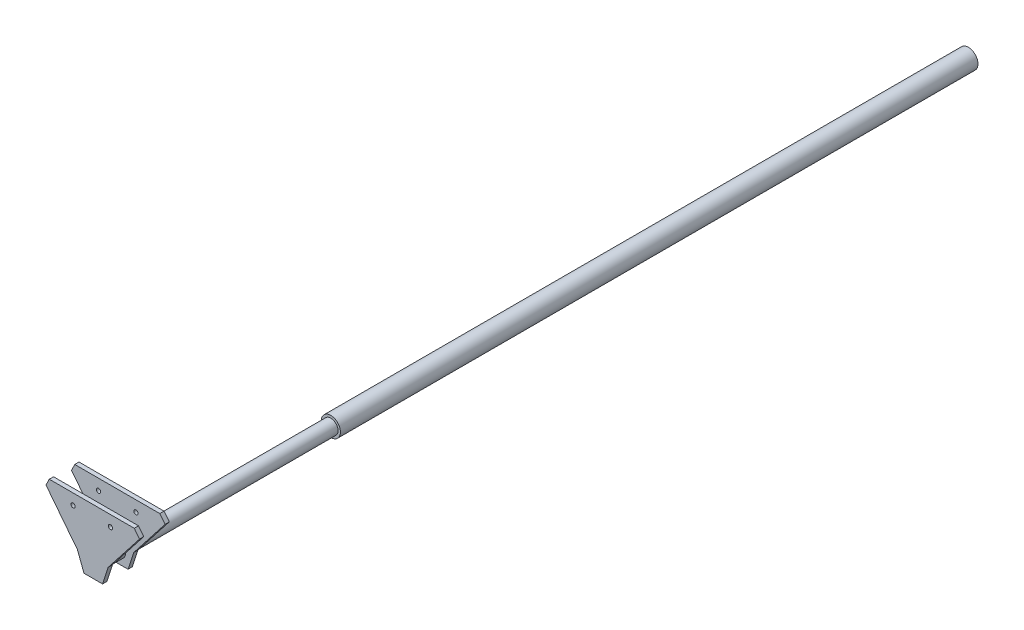
ISO-10303-21;
HEADER;
FILE_DESCRIPTION(('STEP AP214'),'2;1');
FILE_NAME('part.step','',(''),(''),'','','');
FILE_SCHEMA(('AUTOMOTIVE_DESIGN { 1 0 10303 214 1 1 1 1 }'));
ENDSEC;
DATA;
#1=APPLICATION_CONTEXT('core data for automotive mechanical design processes');
#2=APPLICATION_PROTOCOL_DEFINITION('international standard','automotive_design',2000,#1);
#3=PRODUCT_CONTEXT('',#1,'mechanical');
#4=PRODUCT('Part','Part','',(#3));
#5=PRODUCT_RELATED_PRODUCT_CATEGORY('part','',(#4));
#6=PRODUCT_DEFINITION_FORMATION('','',#4);
#7=PRODUCT_DEFINITION_CONTEXT('part definition',#1,'design');
#8=PRODUCT_DEFINITION('design','',#6,#7);
#9=PRODUCT_DEFINITION_SHAPE('','',#8);
#10=(LENGTH_UNIT() NAMED_UNIT(*) SI_UNIT(.MILLI.,.METRE.));
#11=(NAMED_UNIT(*) PLANE_ANGLE_UNIT() SI_UNIT($,.RADIAN.));
#12=(NAMED_UNIT(*) SI_UNIT($,.STERADIAN.) SOLID_ANGLE_UNIT());
#13=UNCERTAINTY_MEASURE_WITH_UNIT(LENGTH_MEASURE(1.E-05),#10,'distance_accuracy_value','');
#14=(GEOMETRIC_REPRESENTATION_CONTEXT(3) GLOBAL_UNCERTAINTY_ASSIGNED_CONTEXT((#13)) GLOBAL_UNIT_ASSIGNED_CONTEXT((#10,
#11,#12)) REPRESENTATION_CONTEXT('',''));
#15=CARTESIAN_POINT('',(0.,0.,0.));
#16=DIRECTION('',(0.,0.,1.));
#17=DIRECTION('',(1.,0.,0.));
#18=AXIS2_PLACEMENT_3D('',#15,#16,#17);
#19=CARTESIAN_POINT('',(0.,0.,370.));
#20=DIRECTION('',(0.,0.,-1.));
#21=DIRECTION('',(-1.,0.,0.));
#22=AXIS2_PLACEMENT_3D('',#19,#20,#21);
#23=CYLINDRICAL_SURFACE('',#22,11.3);
#24=CARTESIAN_POINT('',(0.,0.,370.));
#25=DIRECTION('',(0.,0.,1.));
#26=DIRECTION('',(1.,0.,0.));
#27=AXIS2_PLACEMENT_3D('',#24,#25,#26);
#28=CIRCLE('',#27,11.3);
#29=CARTESIAN_POINT('',(11.3,0.,370.));
#30=VERTEX_POINT('',#29);
#31=EDGE_CURVE('E200',#30,#30,#28,.T.);
#32=ORIENTED_EDGE('',*,*,#31,.F.);
#33=EDGE_LOOP('',(#32));
#34=FACE_BOUND('',#33,.T.);
#35=CARTESIAN_POINT('',(0.,0.,-380.));
#36=DIRECTION('',(0.,0.,1.));
#37=DIRECTION('',(1.,0.,0.));
#38=AXIS2_PLACEMENT_3D('',#35,#36,#37);
#39=CIRCLE('',#38,11.3);
#40=CARTESIAN_POINT('',(11.3,0.,-380.));
#41=VERTEX_POINT('',#40);
#42=EDGE_CURVE('E204',#41,#41,#39,.T.);
#43=ORIENTED_EDGE('',*,*,#42,.T.);
#44=EDGE_LOOP('',(#43));
#45=FACE_BOUND('',#44,.T.);
#46=ADVANCED_FACE('F43',(#34,#45),#23,.T.);
#47=CARTESIAN_POINT('',(0.,0.,370.));
#48=DIRECTION('',(0.,0.,1.));
#49=DIRECTION('',(1.,0.,0.));
#50=AXIS2_PLACEMENT_3D('',#47,#48,#49);
#51=PLANE('',#50);
#52=CARTESIAN_POINT('',(0.,0.,370.));
#53=DIRECTION('',(0.,0.,1.));
#54=DIRECTION('',(1.,0.,0.));
#55=AXIS2_PLACEMENT_3D('',#52,#53,#54);
#56=CIRCLE('',#55,8.5);
#57=CARTESIAN_POINT('',(8.5,0.,370.));
#58=VERTEX_POINT('',#57);
#59=EDGE_CURVE('E53',#58,#58,#56,.T.);
#60=ORIENTED_EDGE('',*,*,#59,.F.);
#61=EDGE_LOOP('',(#60));
#62=FACE_BOUND('',#61,.T.);
#63=ORIENTED_EDGE('',*,*,#31,.T.);
#64=EDGE_LOOP('',(#63));
#65=FACE_BOUND('',#64,.T.);
#66=ADVANCED_FACE('F381',(#62,#65),#51,.T.);
#67=CARTESIAN_POINT('',(0.,0.,-380.));
#68=DIRECTION('',(0.,0.,1.));
#69=DIRECTION('',(1.,0.,0.));
#70=AXIS2_PLACEMENT_3D('',#67,#68,#69);
#71=PLANE('',#70);
#72=ORIENTED_EDGE('',*,*,#42,.F.);
#73=EDGE_LOOP('',(#72));
#74=FACE_BOUND('',#73,.T.);
#75=ADVANCED_FACE('F386',(#74),#71,.F.);
#76=CARTESIAN_POINT('',(0.,0.,650.));
#77=DIRECTION('',(0.,0.,-1.));
#78=DIRECTION('',(-1.,0.,0.));
#79=AXIS2_PLACEMENT_3D('',#76,#77,#78);
#80=CYLINDRICAL_SURFACE('',#79,8.5);
#81=CARTESIAN_POINT('',(0.,0.,615.));
#82=DIRECTION('',(0.,0.,-1.));
#83=DIRECTION('',(-1.,0.,0.));
#84=AXIS2_PLACEMENT_3D('',#81,#82,#83);
#85=CIRCLE('',#84,8.5);
#86=CARTESIAN_POINT('',(-8.5,0.,615.));
#87=VERTEX_POINT('',#86);
#88=EDGE_CURVE('E154',#87,#87,#85,.T.);
#89=ORIENTED_EDGE('',*,*,#88,.T.);
#90=EDGE_LOOP('',(#89));
#91=FACE_BOUND('',#90,.T.);
#92=ORIENTED_EDGE('',*,*,#59,.T.);
#93=EDGE_LOOP('',(#92));
#94=FACE_BOUND('',#93,.T.);
#95=ADVANCED_FACE('F394',(#91,#94),#80,.T.);
#96=CARTESIAN_POINT('',(-10.36978253,-14.68790239,615.));
#97=DIRECTION('',(-0.934741660336349,-0.355328057478783,0.));
#98=DIRECTION('',(0.355328057478783,-0.934741660336349,0.));
#99=AXIS2_PLACEMENT_3D('',#96,#97,#98);
#100=PLANE('',#99);
#101=DIRECTION('',(0.355328057478783,-0.934741660336349,0.));
#102=VECTOR('',#101,1.);
#103=CARTESIAN_POINT('',(-10.36978253,-14.68790239,620.));
#104=LINE('',#103,#102);
#105=CARTESIAN_POINT('',(-18.0715503081688,5.57270762647871,620.));
#106=VERTEX_POINT('',#105);
#107=CARTESIAN_POINT('',(-10.36978253,-14.68790239,620.));
#108=VERTEX_POINT('',#107);
#109=EDGE_CURVE('E252',#106,#108,#104,.T.);
#110=ORIENTED_EDGE('',*,*,#109,.F.);
#111=DIRECTION('',(0.,0.,1.));
#112=VECTOR('',#111,1.);
#113=CARTESIAN_POINT('',(-18.0715503081688,5.57270762647871,615.));
#114=LINE('',#113,#112);
#115=CARTESIAN_POINT('',(-18.0715503081688,5.57270762647871,615.));
#116=VERTEX_POINT('',#115);
#117=EDGE_CURVE('E314',#116,#106,#114,.T.);
#118=ORIENTED_EDGE('',*,*,#117,.F.);
#119=DIRECTION('',(0.355328057478783,-0.934741660336349,0.));
#120=VECTOR('',#119,1.);
#121=CARTESIAN_POINT('',(-10.36978253,-14.68790239,615.));
#122=LINE('',#121,#120);
#123=CARTESIAN_POINT('',(-10.36978253,-14.68790239,615.));
#124=VERTEX_POINT('',#123);
#125=EDGE_CURVE('E276',#116,#124,#122,.T.);
#126=ORIENTED_EDGE('',*,*,#125,.T.);
#127=DIRECTION('',(0.,0.,1.));
#128=VECTOR('',#127,1.);
#129=CARTESIAN_POINT('',(-10.36978253,-14.68790239,615.));
#130=LINE('',#129,#128);
#131=EDGE_CURVE('E213',#124,#108,#130,.T.);
#132=ORIENTED_EDGE('',*,*,#131,.T.);
#133=EDGE_LOOP('',(#110,#118,#126,#132));
#134=FACE_BOUND('',#133,.T.);
#135=ADVANCED_FACE('F398',(#134),#100,.T.);
#136=CARTESIAN_POINT('',(-18.0715503081688,5.57270762647871,615.));
#137=DIRECTION('',(-0.787803300904097,-0.615926910505304,0.));
#138=DIRECTION('',(0.615926910505304,-0.787803300904097,0.));
#139=AXIS2_PLACEMENT_3D('',#136,#137,#138);
#140=PLANE('',#139);
#141=DIRECTION('',(0.615926910505304,-0.787803300904097,0.));
#142=VECTOR('',#141,1.);
#143=CARTESIAN_POINT('',(-18.0715503081688,5.57270762647871,620.));
#144=LINE('',#143,#142);
#145=CARTESIAN_POINT('',(-55.0271649384871,52.8409056807245,620.));
#146=VERTEX_POINT('',#145);
#147=EDGE_CURVE('E304',#146,#106,#144,.T.);
#148=ORIENTED_EDGE('',*,*,#147,.F.);
#149=DIRECTION('',(0.,0.,1.));
#150=VECTOR('',#149,1.);
#151=CARTESIAN_POINT('',(-55.0271649384871,52.8409056807245,615.));
#152=LINE('',#151,#150);
#153=CARTESIAN_POINT('',(-55.0271649384871,52.8409056807245,615.));
#154=VERTEX_POINT('',#153);
#155=EDGE_CURVE('E318',#154,#146,#152,.T.);
#156=ORIENTED_EDGE('',*,*,#155,.F.);
#157=DIRECTION('',(0.615926910505304,-0.787803300904097,0.));
#158=VECTOR('',#157,1.);
#159=CARTESIAN_POINT('',(-18.0715503081688,5.57270762647871,615.));
#160=LINE('',#159,#158);
#161=EDGE_CURVE('E272',#154,#116,#160,.T.);
#162=ORIENTED_EDGE('',*,*,#161,.T.);
#163=ORIENTED_EDGE('',*,*,#117,.T.);
#164=EDGE_LOOP('',(#148,#156,#162,#163));
#165=FACE_BOUND('',#164,.T.);
#166=ADVANCED_FACE('F534',(#165),#140,.T.);
#167=CARTESIAN_POINT('',(-51.1864340438746,60.7188569042528,615.));
#168=DIRECTION('',(-0.898866082182163,0.438223420531683,0.));
#169=DIRECTION('',(-0.438223420531683,-0.898866082182163,0.));
#170=AXIS2_PLACEMENT_3D('',#167,#168,#169);
#171=PLANE('',#170);
#172=DIRECTION('',(-0.438223420531683,-0.898866082182163,0.));
#173=VECTOR('',#172,1.);
#174=CARTESIAN_POINT('',(-51.1864340438746,60.7188569042528,620.));
#175=LINE('',#174,#173);
#176=CARTESIAN_POINT('',(-51.1864340438746,60.7188569042528,620.));
#177=VERTEX_POINT('',#176);
#178=EDGE_CURVE('E300',#177,#146,#175,.T.);
#179=ORIENTED_EDGE('',*,*,#178,.F.);
#180=DIRECTION('',(0.,0.,1.));
#181=VECTOR('',#180,1.);
#182=CARTESIAN_POINT('',(-51.1864340438746,60.7188569042528,615.));
#183=LINE('',#182,#181);
#184=CARTESIAN_POINT('',(-51.1864340438746,60.7188569042528,615.));
#185=VERTEX_POINT('',#184);
#186=EDGE_CURVE('E322',#185,#177,#183,.T.);
#187=ORIENTED_EDGE('',*,*,#186,.F.);
#188=DIRECTION('',(-0.438223420531683,-0.898866082182163,0.));
#189=VECTOR('',#188,1.);
#190=CARTESIAN_POINT('',(-51.1864340438746,60.7188569042528,615.));
#191=LINE('',#190,#189);
#192=EDGE_CURVE('E268',#185,#154,#191,.T.);
#193=ORIENTED_EDGE('',*,*,#192,.T.);
#194=ORIENTED_EDGE('',*,*,#155,.T.);
#195=EDGE_LOOP('',(#179,#187,#193,#194));
#196=FACE_BOUND('',#195,.T.);
#197=ADVANCED_FACE('F544',(#196),#171,.T.);
#198=CARTESIAN_POINT('',(-51.1864340438746,60.7188569042528,615.));
#199=DIRECTION('',(0.,1.,0.));
#200=DIRECTION('',(0.,0.,1.));
#201=AXIS2_PLACEMENT_3D('',#198,#199,#200);
#202=PLANE('',#201);
#203=DIRECTION('',(-1.,0.,0.));
#204=VECTOR('',#203,1.);
#205=CARTESIAN_POINT('',(-51.1864340438746,60.7188569042528,620.));
#206=LINE('',#205,#204);
#207=CARTESIAN_POINT('',(48.8135659561254,60.7188569042528,620.));
#208=VERTEX_POINT('',#207);
#209=EDGE_CURVE('E296',#208,#177,#206,.T.);
#210=ORIENTED_EDGE('',*,*,#209,.F.);
#211=DIRECTION('',(0.,0.,1.));
#212=VECTOR('',#211,1.);
#213=CARTESIAN_POINT('',(48.8135659561254,60.7188569042528,615.));
#214=LINE('',#213,#212);
#215=CARTESIAN_POINT('',(48.8135659561254,60.7188569042528,615.));
#216=VERTEX_POINT('',#215);
#217=EDGE_CURVE('E326',#216,#208,#214,.T.);
#218=ORIENTED_EDGE('',*,*,#217,.F.);
#219=DIRECTION('',(-1.,0.,0.));
#220=VECTOR('',#219,1.);
#221=CARTESIAN_POINT('',(-51.1864340438746,60.7188569042528,615.));
#222=LINE('',#221,#220);
#223=EDGE_CURVE('E264',#216,#185,#222,.T.);
#224=ORIENTED_EDGE('',*,*,#223,.T.);
#225=ORIENTED_EDGE('',*,*,#186,.T.);
#226=EDGE_LOOP('',(#210,#218,#224,#225));
#227=FACE_BOUND('',#226,.T.);
#228=ADVANCED_FACE('F554',(#227),#202,.T.);
#229=CARTESIAN_POINT('',(48.8135659561254,60.7188569042528,615.));
#230=DIRECTION('',(0.785108717675389,0.61935797518891,0.));
#231=DIRECTION('',(-0.61935797518891,0.785108717675389,0.));
#232=AXIS2_PLACEMENT_3D('',#229,#230,#231);
#233=PLANE('',#232);
#234=DIRECTION('',(-0.61935797518891,0.785108717675389,0.));
#235=VECTOR('',#234,1.);
#236=CARTESIAN_POINT('',(48.8135659561254,60.7188569042528,620.));
#237=LINE('',#236,#235);
#238=CARTESIAN_POINT('',(55.0290195643902,52.840042054622,620.));
#239=VERTEX_POINT('',#238);
#240=EDGE_CURVE('E292',#239,#208,#237,.T.);
#241=ORIENTED_EDGE('',*,*,#240,.F.);
#242=DIRECTION('',(0.,0.,1.));
#243=VECTOR('',#242,1.);
#244=CARTESIAN_POINT('',(55.0290195643902,52.840042054622,615.));
#245=LINE('',#244,#243);
#246=CARTESIAN_POINT('',(55.0290195643902,52.840042054622,615.));
#247=VERTEX_POINT('',#246);
#248=EDGE_CURVE('E330',#247,#239,#245,.T.);
#249=ORIENTED_EDGE('',*,*,#248,.F.);
#250=DIRECTION('',(-0.61935797518891,0.785108717675389,0.));
#251=VECTOR('',#250,1.);
#252=CARTESIAN_POINT('',(48.8135659561254,60.7188569042528,615.));
#253=LINE('',#252,#251);
#254=EDGE_CURVE('E260',#247,#216,#253,.T.);
#255=ORIENTED_EDGE('',*,*,#254,.T.);
#256=ORIENTED_EDGE('',*,*,#217,.T.);
#257=EDGE_LOOP('',(#241,#249,#255,#256));
#258=FACE_BOUND('',#257,.T.);
#259=ADVANCED_FACE('F564',(#258),#233,.T.);
#260=CARTESIAN_POINT('',(18.0728292370506,5.57229410224489,615.));
#261=DIRECTION('',(0.787795799206285,-0.61593650545566,0.));
#262=DIRECTION('',(0.61593650545566,0.787795799206285,0.));
#263=AXIS2_PLACEMENT_3D('',#260,#261,#262);
#264=PLANE('',#263);
#265=DIRECTION('',(0.61593650545566,0.787795799206285,0.));
#266=VECTOR('',#265,1.);
#267=CARTESIAN_POINT('',(18.0728292370506,5.57229410224489,620.));
#268=LINE('',#267,#266);
#269=CARTESIAN_POINT('',(18.0728292370506,5.57229410224489,620.));
#270=VERTEX_POINT('',#269);
#271=EDGE_CURVE('E288',#270,#239,#268,.T.);
#272=ORIENTED_EDGE('',*,*,#271,.F.);
#273=DIRECTION('',(0.,0.,1.));
#274=VECTOR('',#273,1.);
#275=CARTESIAN_POINT('',(18.0728292370506,5.57229410224489,615.));
#276=LINE('',#275,#274);
#277=CARTESIAN_POINT('',(18.0728292370506,5.57229410224489,615.));
#278=VERTEX_POINT('',#277);
#279=EDGE_CURVE('E334',#278,#270,#276,.T.);
#280=ORIENTED_EDGE('',*,*,#279,.F.);
#281=DIRECTION('',(0.61593650545566,0.787795799206285,0.));
#282=VECTOR('',#281,1.);
#283=CARTESIAN_POINT('',(18.0728292370506,5.57229410224489,615.));
#284=LINE('',#283,#282);
#285=EDGE_CURVE('E256',#278,#247,#284,.T.);
#286=ORIENTED_EDGE('',*,*,#285,.T.);
#287=ORIENTED_EDGE('',*,*,#248,.T.);
#288=EDGE_LOOP('',(#272,#280,#286,#287));
#289=FACE_BOUND('',#288,.T.);
#290=ADVANCED_FACE('F574',(#289),#264,.T.);
#291=CARTESIAN_POINT('',(11.52115326,-14.68790239,615.));
#292=DIRECTION('',(0.951487058208004,-0.307688768177648,0.));
#293=DIRECTION('',(0.307688768177648,0.951487058208004,0.));
#294=AXIS2_PLACEMENT_3D('',#291,#292,#293);
#295=PLANE('',#294);
#296=DIRECTION('',(0.307688768177648,0.951487058208004,0.));
#297=VECTOR('',#296,1.);
#298=CARTESIAN_POINT('',(11.52115326,-14.68790239,620.));
#299=LINE('',#298,#297);
#300=CARTESIAN_POINT('',(11.52115326,-14.68790239,620.));
#301=VERTEX_POINT('',#300);
#302=EDGE_CURVE('E284',#301,#270,#299,.T.);
#303=ORIENTED_EDGE('',*,*,#302,.F.);
#304=DIRECTION('',(0.,0.,1.));
#305=VECTOR('',#304,1.);
#306=CARTESIAN_POINT('',(11.52115326,-14.68790239,615.));
#307=LINE('',#306,#305);
#308=CARTESIAN_POINT('',(11.52115326,-14.68790239,615.));
#309=VERTEX_POINT('',#308);
#310=EDGE_CURVE('E280',#309,#301,#307,.T.);
#311=ORIENTED_EDGE('',*,*,#310,.F.);
#312=DIRECTION('',(0.307688768177648,0.951487058208004,0.));
#313=VECTOR('',#312,1.);
#314=CARTESIAN_POINT('',(11.52115326,-14.68790239,615.));
#315=LINE('',#314,#313);
#316=EDGE_CURVE('E251',#309,#278,#315,.T.);
#317=ORIENTED_EDGE('',*,*,#316,.T.);
#318=ORIENTED_EDGE('',*,*,#279,.T.);
#319=EDGE_LOOP('',(#303,#311,#317,#318));
#320=FACE_BOUND('',#319,.T.);
#321=ADVANCED_FACE('F584',(#320),#295,.T.);
#322=CARTESIAN_POINT('',(0.,-14.68790239,615.));
#323=DIRECTION('',(0.,-1.,0.));
#324=DIRECTION('',(0.,0.,-1.));
#325=AXIS2_PLACEMENT_3D('',#322,#323,#324);
#326=PLANE('',#325);
#327=DIRECTION('',(1.,0.,0.));
#328=VECTOR('',#327,1.);
#329=CARTESIAN_POINT('',(0.,-14.68790239,620.));
#330=LINE('',#329,#328);
#331=EDGE_CURVE('E246',#108,#301,#330,.T.);
#332=ORIENTED_EDGE('',*,*,#331,.F.);
#333=ORIENTED_EDGE('',*,*,#131,.F.);
#334=DIRECTION('',(1.,0.,0.));
#335=VECTOR('',#334,1.);
#336=CARTESIAN_POINT('',(0.,-14.68790239,615.));
#337=LINE('',#336,#335);
#338=EDGE_CURVE('E247',#124,#309,#337,.T.);
#339=ORIENTED_EDGE('',*,*,#338,.T.);
#340=ORIENTED_EDGE('',*,*,#310,.T.);
#341=EDGE_LOOP('',(#332,#333,#339,#340));
#342=FACE_BOUND('',#341,.T.);
#343=ADVANCED_FACE('F594',(#342),#326,.T.);
#344=CARTESIAN_POINT('',(0.,0.,615.));
#345=DIRECTION('',(0.,0.,-1.));
#346=DIRECTION('',(-1.,0.,0.));
#347=AXIS2_PLACEMENT_3D('',#344,#345,#346);
#348=PLANE('',#347);
#349=CARTESIAN_POINT('',(-23.1865173938746,47.9372896542528,615.));
#350=DIRECTION('',(0.,0.,-1.));
#351=DIRECTION('',(-1.,0.,0.));
#352=AXIS2_PLACEMENT_3D('',#349,#350,#351);
#353=CIRCLE('',#352,2.5);
#354=CARTESIAN_POINT('',(-25.6865173938746,47.9372896542528,615.));
#355=VERTEX_POINT('',#354);
#356=EDGE_CURVE('E242',#355,#355,#353,.T.);
#357=ORIENTED_EDGE('',*,*,#356,.F.);
#358=EDGE_LOOP('',(#357));
#359=FACE_BOUND('',#358,.T.);
#360=CARTESIAN_POINT('',(20.8136493061254,47.9372896542528,615.));
#361=DIRECTION('',(0.,0.,-1.));
#362=DIRECTION('',(-1.,0.,0.));
#363=AXIS2_PLACEMENT_3D('',#360,#361,#362);
#364=CIRCLE('',#363,2.5);
#365=CARTESIAN_POINT('',(18.3136493061254,47.9372896542528,615.));
#366=VERTEX_POINT('',#365);
#367=EDGE_CURVE('E224',#366,#366,#364,.T.);
#368=ORIENTED_EDGE('',*,*,#367,.F.);
#369=EDGE_LOOP('',(#368));
#370=FACE_BOUND('',#369,.T.);
#371=ORIENTED_EDGE('',*,*,#88,.F.);
#372=EDGE_LOOP('',(#371));
#373=FACE_BOUND('',#372,.T.);
#374=ORIENTED_EDGE('',*,*,#338,.F.);
#375=ORIENTED_EDGE('',*,*,#125,.F.);
#376=ORIENTED_EDGE('',*,*,#161,.F.);
#377=ORIENTED_EDGE('',*,*,#192,.F.);
#378=ORIENTED_EDGE('',*,*,#223,.F.);
#379=ORIENTED_EDGE('',*,*,#254,.F.);
#380=ORIENTED_EDGE('',*,*,#285,.F.);
#381=ORIENTED_EDGE('',*,*,#316,.F.);
#382=EDGE_LOOP('',(#374,#375,#376,#377,#378,#379,#380,#381));
#383=FACE_BOUND('',#382,.T.);
#384=ADVANCED_FACE('F604',(#359,#370,#373,#383),#348,.T.);
#385=CARTESIAN_POINT('',(0.,0.,620.));
#386=DIRECTION('',(0.,0.,-1.));
#387=DIRECTION('',(-1.,0.,0.));
#388=AXIS2_PLACEMENT_3D('',#385,#386,#387);
#389=PLANE('',#388);
#390=CARTESIAN_POINT('',(-23.1865173938746,47.9372896542528,620.));
#391=DIRECTION('',(0.,0.,-1.));
#392=DIRECTION('',(-1.,0.,0.));
#393=AXIS2_PLACEMENT_3D('',#390,#391,#392);
#394=CIRCLE('',#393,2.5);
#395=CARTESIAN_POINT('',(-25.6865173938746,47.9372896542528,620.));
#396=VERTEX_POINT('',#395);
#397=EDGE_CURVE('E238',#396,#396,#394,.T.);
#398=ORIENTED_EDGE('',*,*,#397,.T.);
#399=EDGE_LOOP('',(#398));
#400=FACE_BOUND('',#399,.T.);
#401=CARTESIAN_POINT('',(20.8136493061254,47.9372896542528,620.));
#402=DIRECTION('',(0.,0.,-1.));
#403=DIRECTION('',(-1.,0.,0.));
#404=AXIS2_PLACEMENT_3D('',#401,#402,#403);
#405=CIRCLE('',#404,2.5);
#406=CARTESIAN_POINT('',(18.3136493061254,47.9372896542528,620.));
#407=VERTEX_POINT('',#406);
#408=EDGE_CURVE('E217',#407,#407,#405,.T.);
#409=ORIENTED_EDGE('',*,*,#408,.T.);
#410=EDGE_LOOP('',(#409));
#411=FACE_BOUND('',#410,.T.);
#412=CARTESIAN_POINT('',(0.,0.,620.));
#413=DIRECTION('',(0.,0.,-1.));
#414=DIRECTION('',(-1.,0.,0.));
#415=AXIS2_PLACEMENT_3D('',#412,#413,#414);
#416=CIRCLE('',#415,8.5);
#417=CARTESIAN_POINT('',(-8.5,0.,620.));
#418=VERTEX_POINT('',#417);
#419=EDGE_CURVE('E11',#418,#418,#416,.T.);
#420=ORIENTED_EDGE('',*,*,#419,.T.);
#421=EDGE_LOOP('',(#420));
#422=FACE_BOUND('',#421,.T.);
#423=ORIENTED_EDGE('',*,*,#109,.T.);
#424=ORIENTED_EDGE('',*,*,#331,.T.);
#425=ORIENTED_EDGE('',*,*,#302,.T.);
#426=ORIENTED_EDGE('',*,*,#271,.T.);
#427=ORIENTED_EDGE('',*,*,#240,.T.);
#428=ORIENTED_EDGE('',*,*,#209,.T.);
#429=ORIENTED_EDGE('',*,*,#178,.T.);
#430=ORIENTED_EDGE('',*,*,#147,.T.);
#431=EDGE_LOOP('',(#423,#424,#425,#426,#427,#428,#429,#430));
#432=FACE_BOUND('',#431,.T.);
#433=ADVANCED_FACE('F405',(#400,#411,#422,#432),#389,.F.);
#434=CARTESIAN_POINT('',(0.,0.,650.));
#435=DIRECTION('',(0.,0.,1.));
#436=DIRECTION('',(1.,0.,0.));
#437=AXIS2_PLACEMENT_3D('',#434,#435,#436);
#438=PLANE('',#437);
#439=CARTESIAN_POINT('',(-23.1865173938746,47.9372896542528,650.));
#440=DIRECTION('',(0.,0.,1.));
#441=DIRECTION('',(1.,0.,0.));
#442=AXIS2_PLACEMENT_3D('',#439,#440,#441);
#443=CIRCLE('',#442,2.5);
#444=CARTESIAN_POINT('',(-20.6865173938746,47.9372896542528,650.));
#445=VERTEX_POINT('',#444);
#446=EDGE_CURVE('E218',#445,#445,#443,.T.);
#447=ORIENTED_EDGE('',*,*,#446,.F.);
#448=EDGE_LOOP('',(#447));
#449=FACE_BOUND('',#448,.T.);
#450=CARTESIAN_POINT('',(20.8136493061254,47.9372896542528,650.));
#451=DIRECTION('',(0.,0.,1.));
#452=DIRECTION('',(-1.,0.,0.));
#453=AXIS2_PLACEMENT_3D('',#450,#451,#452);
#454=CIRCLE('',#453,2.5);
#455=CARTESIAN_POINT('',(18.3136493061254,47.9372896542528,650.));
#456=VERTEX_POINT('',#455);
#457=EDGE_CURVE('E227',#456,#456,#454,.T.);
#458=ORIENTED_EDGE('',*,*,#457,.F.);
#459=EDGE_LOOP('',(#458));
#460=FACE_BOUND('',#459,.T.);
#461=DIRECTION('',(0.355328057478783,-0.934741660336349,0.));
#462=VECTOR('',#461,1.);
#463=CARTESIAN_POINT('',(-10.36978253,-14.68790239,650.));
#464=LINE('',#463,#462);
#465=CARTESIAN_POINT('',(-18.0715503081688,5.57270762647871,650.));
#466=VERTEX_POINT('',#465);
#467=CARTESIAN_POINT('',(-10.36978253,-14.68790239,650.));
#468=VERTEX_POINT('',#467);
#469=EDGE_CURVE('E175',#466,#468,#464,.T.);
#470=ORIENTED_EDGE('',*,*,#469,.T.);
#471=DIRECTION('',(1.,0.,0.));
#472=VECTOR('',#471,1.);
#473=CARTESIAN_POINT('',(0.,-14.68790239,650.));
#474=LINE('',#473,#472);
#475=CARTESIAN_POINT('',(11.52115326,-14.68790239,650.));
#476=VERTEX_POINT('',#475);
#477=EDGE_CURVE('E96',#468,#476,#474,.T.);
#478=ORIENTED_EDGE('',*,*,#477,.T.);
#479=DIRECTION('',(0.307688768177648,0.951487058208004,0.));
#480=VECTOR('',#479,1.);
#481=CARTESIAN_POINT('',(11.52115326,-14.68790239,650.));
#482=LINE('',#481,#480);
#483=CARTESIAN_POINT('',(18.0728292370506,5.57229410224489,650.));
#484=VERTEX_POINT('',#483);
#485=EDGE_CURVE('E153',#476,#484,#482,.T.);
#486=ORIENTED_EDGE('',*,*,#485,.T.);
#487=DIRECTION('',(0.61593650545566,0.787795799206285,0.));
#488=VECTOR('',#487,1.);
#489=CARTESIAN_POINT('',(18.0728292370506,5.57229410224489,650.));
#490=LINE('',#489,#488);
#491=CARTESIAN_POINT('',(55.0290195643902,52.840042054622,650.));
#492=VERTEX_POINT('',#491);
#493=EDGE_CURVE('E158',#484,#492,#490,.T.);
#494=ORIENTED_EDGE('',*,*,#493,.T.);
#495=DIRECTION('',(-0.61935797518891,0.785108717675389,0.));
#496=VECTOR('',#495,1.);
#497=CARTESIAN_POINT('',(48.8135659561254,60.7188569042528,650.));
#498=LINE('',#497,#496);
#499=CARTESIAN_POINT('',(48.8135659561254,60.7188569042528,650.));
#500=VERTEX_POINT('',#499);
#501=EDGE_CURVE('E162',#492,#500,#498,.T.);
#502=ORIENTED_EDGE('',*,*,#501,.T.);
#503=DIRECTION('',(-1.,0.,0.));
#504=VECTOR('',#503,1.);
#505=CARTESIAN_POINT('',(-51.1864340438746,60.7188569042528,650.));
#506=LINE('',#505,#504);
#507=CARTESIAN_POINT('',(-51.1864340438746,60.7188569042528,650.));
#508=VERTEX_POINT('',#507);
#509=EDGE_CURVE('E166',#500,#508,#506,.T.);
#510=ORIENTED_EDGE('',*,*,#509,.T.);
#511=DIRECTION('',(-0.438223420531683,-0.898866082182163,0.));
#512=VECTOR('',#511,1.);
#513=CARTESIAN_POINT('',(-51.1864340438746,60.7188569042528,650.));
#514=LINE('',#513,#512);
#515=CARTESIAN_POINT('',(-55.0271649384871,52.8409056807245,650.));
#516=VERTEX_POINT('',#515);
#517=EDGE_CURVE('E170',#508,#516,#514,.T.);
#518=ORIENTED_EDGE('',*,*,#517,.T.);
#519=DIRECTION('',(0.615926910505304,-0.787803300904097,0.));
#520=VECTOR('',#519,1.);
#521=CARTESIAN_POINT('',(-18.0715503081688,5.57270762647871,650.));
#522=LINE('',#521,#520);
#523=EDGE_CURVE('E121',#516,#466,#522,.T.);
#524=ORIENTED_EDGE('',*,*,#523,.T.);
#525=EDGE_LOOP('',(#470,#478,#486,#494,#502,#510,#518,#524));
#526=FACE_BOUND('',#525,.T.);
#527=ADVANCED_FACE('F369',(#449,#460,#526),#438,.T.);
#528=CARTESIAN_POINT('',(11.52115326,-14.68790239,645.));
#529=DIRECTION('',(0.951487058208004,-0.307688768177648,0.));
#530=DIRECTION('',(0.307688768177648,0.951487058208004,0.));
#531=AXIS2_PLACEMENT_3D('',#528,#529,#530);
#532=PLANE('',#531);
#533=ORIENTED_EDGE('',*,*,#485,.F.);
#534=DIRECTION('',(0.,0.,1.));
#535=VECTOR('',#534,1.);
#536=CARTESIAN_POINT('',(11.52115326,-14.68790239,645.));
#537=LINE('',#536,#535);
#538=CARTESIAN_POINT('',(11.52115326,-14.68790239,645.));
#539=VERTEX_POINT('',#538);
#540=EDGE_CURVE('E150',#539,#476,#537,.T.);
#541=ORIENTED_EDGE('',*,*,#540,.F.);
#542=DIRECTION('',(0.307688768177648,0.951487058208004,0.));
#543=VECTOR('',#542,1.);
#544=CARTESIAN_POINT('',(11.52115326,-14.68790239,645.));
#545=LINE('',#544,#543);
#546=CARTESIAN_POINT('',(18.0728292370506,5.57229410224489,645.));
#547=VERTEX_POINT('',#546);
#548=EDGE_CURVE('E343',#539,#547,#545,.T.);
#549=ORIENTED_EDGE('',*,*,#548,.T.);
#550=DIRECTION('',(0.,0.,1.));
#551=VECTOR('',#550,1.);
#552=CARTESIAN_POINT('',(18.0728292370506,5.57229410224489,645.));
#553=LINE('',#552,#551);
#554=EDGE_CURVE('E192',#547,#484,#553,.T.);
#555=ORIENTED_EDGE('',*,*,#554,.T.);
#556=EDGE_LOOP('',(#533,#541,#549,#555));
#557=FACE_BOUND('',#556,.T.);
#558=ADVANCED_FACE('F364',(#557),#532,.T.);
#559=CARTESIAN_POINT('',(18.0728292370506,5.57229410224489,645.));
#560=DIRECTION('',(0.787795799206285,-0.61593650545566,0.));
#561=DIRECTION('',(0.61593650545566,0.787795799206285,0.));
#562=AXIS2_PLACEMENT_3D('',#559,#560,#561);
#563=PLANE('',#562);
#564=ORIENTED_EDGE('',*,*,#493,.F.);
#565=ORIENTED_EDGE('',*,*,#554,.F.);
#566=DIRECTION('',(0.61593650545566,0.787795799206285,0.));
#567=VECTOR('',#566,1.);
#568=CARTESIAN_POINT('',(18.0728292370506,5.57229410224489,645.));
#569=LINE('',#568,#567);
#570=CARTESIAN_POINT('',(55.0290195643902,52.840042054622,645.));
#571=VERTEX_POINT('',#570);
#572=EDGE_CURVE('E347',#547,#571,#569,.T.);
#573=ORIENTED_EDGE('',*,*,#572,.T.);
#574=DIRECTION('',(0.,0.,1.));
#575=VECTOR('',#574,1.);
#576=CARTESIAN_POINT('',(55.0290195643902,52.840042054622,645.));
#577=LINE('',#576,#575);
#578=EDGE_CURVE('E189',#571,#492,#577,.T.);
#579=ORIENTED_EDGE('',*,*,#578,.T.);
#580=EDGE_LOOP('',(#564,#565,#573,#579));
#581=FACE_BOUND('',#580,.T.);
#582=ADVANCED_FACE('F361',(#581),#563,.T.);
#583=CARTESIAN_POINT('',(48.8135659561254,60.7188569042528,645.));
#584=DIRECTION('',(0.785108717675389,0.61935797518891,0.));
#585=DIRECTION('',(-0.61935797518891,0.785108717675389,0.));
#586=AXIS2_PLACEMENT_3D('',#583,#584,#585);
#587=PLANE('',#586);
#588=ORIENTED_EDGE('',*,*,#501,.F.);
#589=ORIENTED_EDGE('',*,*,#578,.F.);
#590=DIRECTION('',(-0.61935797518891,0.785108717675389,0.));
#591=VECTOR('',#590,1.);
#592=CARTESIAN_POINT('',(48.8135659561254,60.7188569042528,645.));
#593=LINE('',#592,#591);
#594=CARTESIAN_POINT('',(48.8135659561254,60.7188569042528,645.));
#595=VERTEX_POINT('',#594);
#596=EDGE_CURVE('E144',#571,#595,#593,.T.);
#597=ORIENTED_EDGE('',*,*,#596,.T.);
#598=DIRECTION('',(0.,0.,1.));
#599=VECTOR('',#598,1.);
#600=CARTESIAN_POINT('',(48.8135659561254,60.7188569042528,645.));
#601=LINE('',#600,#599);
#602=EDGE_CURVE('E186',#595,#500,#601,.T.);
#603=ORIENTED_EDGE('',*,*,#602,.T.);
#604=EDGE_LOOP('',(#588,#589,#597,#603));
#605=FACE_BOUND('',#604,.T.);
#606=ADVANCED_FACE('F355',(#605),#587,.T.);
#607=CARTESIAN_POINT('',(-51.1864340438746,60.7188569042528,645.));
#608=DIRECTION('',(0.,1.,0.));
#609=DIRECTION('',(0.,0.,1.));
#610=AXIS2_PLACEMENT_3D('',#607,#608,#609);
#611=PLANE('',#610);
#612=ORIENTED_EDGE('',*,*,#509,.F.);
#613=ORIENTED_EDGE('',*,*,#602,.F.);
#614=DIRECTION('',(-1.,0.,0.));
#615=VECTOR('',#614,1.);
#616=CARTESIAN_POINT('',(-51.1864340438746,60.7188569042528,645.));
#617=LINE('',#616,#615);
#618=CARTESIAN_POINT('',(-51.1864340438746,60.7188569042528,645.));
#619=VERTEX_POINT('',#618);
#620=EDGE_CURVE('E141',#595,#619,#617,.T.);
#621=ORIENTED_EDGE('',*,*,#620,.T.);
#622=DIRECTION('',(0.,0.,1.));
#623=VECTOR('',#622,1.);
#624=CARTESIAN_POINT('',(-51.1864340438746,60.7188569042528,645.));
#625=LINE('',#624,#623);
#626=EDGE_CURVE('E127',#619,#508,#625,.T.);
#627=ORIENTED_EDGE('',*,*,#626,.T.);
#628=EDGE_LOOP('',(#612,#613,#621,#627));
#629=FACE_BOUND('',#628,.T.);
#630=ADVANCED_FACE('F371',(#629),#611,.T.);
#631=CARTESIAN_POINT('',(-51.1864340438746,60.7188569042528,645.));
#632=DIRECTION('',(-0.898866082182163,0.438223420531683,0.));
#633=DIRECTION('',(-0.438223420531683,-0.898866082182163,0.));
#634=AXIS2_PLACEMENT_3D('',#631,#632,#633);
#635=PLANE('',#634);
#636=ORIENTED_EDGE('',*,*,#517,.F.);
#637=ORIENTED_EDGE('',*,*,#626,.F.);
#638=DIRECTION('',(-0.438223420531683,-0.898866082182163,0.));
#639=VECTOR('',#638,1.);
#640=CARTESIAN_POINT('',(-51.1864340438746,60.7188569042528,645.));
#641=LINE('',#640,#639);
#642=CARTESIAN_POINT('',(-55.0271649384871,52.8409056807245,645.));
#643=VERTEX_POINT('',#642);
#644=EDGE_CURVE('E133',#619,#643,#641,.T.);
#645=ORIENTED_EDGE('',*,*,#644,.T.);
#646=DIRECTION('',(0.,0.,1.));
#647=VECTOR('',#646,1.);
#648=CARTESIAN_POINT('',(-55.0271649384871,52.8409056807245,645.));
#649=LINE('',#648,#647);
#650=EDGE_CURVE('E116',#643,#516,#649,.T.);
#651=ORIENTED_EDGE('',*,*,#650,.T.);
#652=EDGE_LOOP('',(#636,#637,#645,#651));
#653=FACE_BOUND('',#652,.T.);
#654=ADVANCED_FACE('F139',(#653),#635,.T.);
#655=CARTESIAN_POINT('',(-18.0715503081688,5.57270762647871,645.));
#656=DIRECTION('',(-0.787803300904097,-0.615926910505304,0.));
#657=DIRECTION('',(0.615926910505304,-0.787803300904097,0.));
#658=AXIS2_PLACEMENT_3D('',#655,#656,#657);
#659=PLANE('',#658);
#660=ORIENTED_EDGE('',*,*,#523,.F.);
#661=ORIENTED_EDGE('',*,*,#650,.F.);
#662=DIRECTION('',(0.615926910505304,-0.787803300904097,0.));
#663=VECTOR('',#662,1.);
#664=CARTESIAN_POINT('',(-18.0715503081688,5.57270762647871,645.));
#665=LINE('',#664,#663);
#666=CARTESIAN_POINT('',(-18.0715503081688,5.57270762647871,645.));
#667=VERTEX_POINT('',#666);
#668=EDGE_CURVE('E119',#643,#667,#665,.T.);
#669=ORIENTED_EDGE('',*,*,#668,.T.);
#670=DIRECTION('',(0.,0.,1.));
#671=VECTOR('',#670,1.);
#672=CARTESIAN_POINT('',(-18.0715503081688,5.57270762647871,645.));
#673=LINE('',#672,#671);
#674=EDGE_CURVE('E92',#667,#466,#673,.T.);
#675=ORIENTED_EDGE('',*,*,#674,.T.);
#676=EDGE_LOOP('',(#660,#661,#669,#675));
#677=FACE_BOUND('',#676,.T.);
#678=ADVANCED_FACE('F118',(#677),#659,.T.);
#679=CARTESIAN_POINT('',(-10.36978253,-14.68790239,645.));
#680=DIRECTION('',(-0.934741660336349,-0.355328057478783,0.));
#681=DIRECTION('',(0.355328057478783,-0.934741660336349,0.));
#682=AXIS2_PLACEMENT_3D('',#679,#680,#681);
#683=PLANE('',#682);
#684=ORIENTED_EDGE('',*,*,#469,.F.);
#685=ORIENTED_EDGE('',*,*,#674,.F.);
#686=DIRECTION('',(0.355328057478783,-0.934741660336349,0.));
#687=VECTOR('',#686,1.);
#688=CARTESIAN_POINT('',(-10.36978253,-14.68790239,645.));
#689=LINE('',#688,#687);
#690=CARTESIAN_POINT('',(-10.36978253,-14.68790239,645.));
#691=VERTEX_POINT('',#690);
#692=EDGE_CURVE('E136',#667,#691,#689,.T.);
#693=ORIENTED_EDGE('',*,*,#692,.T.);
#694=DIRECTION('',(0.,0.,1.));
#695=VECTOR('',#694,1.);
#696=CARTESIAN_POINT('',(-10.36978253,-14.68790239,645.));
#697=LINE('',#696,#695);
#698=EDGE_CURVE('E62',#691,#468,#697,.T.);
#699=ORIENTED_EDGE('',*,*,#698,.T.);
#700=EDGE_LOOP('',(#684,#685,#693,#699));
#701=FACE_BOUND('',#700,.T.);
#702=ADVANCED_FACE('F367',(#701),#683,.T.);
#703=CARTESIAN_POINT('',(0.,-14.68790239,645.));
#704=DIRECTION('',(0.,-1.,0.));
#705=DIRECTION('',(0.,0.,-1.));
#706=AXIS2_PLACEMENT_3D('',#703,#704,#705);
#707=PLANE('',#706);
#708=ORIENTED_EDGE('',*,*,#477,.F.);
#709=ORIENTED_EDGE('',*,*,#698,.F.);
#710=DIRECTION('',(1.,0.,0.));
#711=VECTOR('',#710,1.);
#712=CARTESIAN_POINT('',(0.,-14.68790239,645.));
#713=LINE('',#712,#711);
#714=EDGE_CURVE('E99',#691,#539,#713,.T.);
#715=ORIENTED_EDGE('',*,*,#714,.T.);
#716=ORIENTED_EDGE('',*,*,#540,.T.);
#717=EDGE_LOOP('',(#708,#709,#715,#716));
#718=FACE_BOUND('',#717,.T.);
#719=ADVANCED_FACE('F407',(#718),#707,.T.);
#720=CARTESIAN_POINT('',(0.,0.,645.));
#721=DIRECTION('',(0.,0.,-1.));
#722=DIRECTION('',(-1.,0.,0.));
#723=AXIS2_PLACEMENT_3D('',#720,#721,#722);
#724=PLANE('',#723);
#725=CARTESIAN_POINT('',(-23.1865173938746,47.9372896542528,645.));
#726=DIRECTION('',(0.,0.,-1.));
#727=DIRECTION('',(-1.,0.,0.));
#728=AXIS2_PLACEMENT_3D('',#725,#726,#727);
#729=CIRCLE('',#728,2.5);
#730=CARTESIAN_POINT('',(-25.6865173938746,47.9372896542528,645.));
#731=VERTEX_POINT('',#730);
#732=EDGE_CURVE('E46',#731,#731,#729,.T.);
#733=ORIENTED_EDGE('',*,*,#732,.F.);
#734=EDGE_LOOP('',(#733));
#735=FACE_BOUND('',#734,.T.);
#736=CARTESIAN_POINT('',(20.8136493061254,47.9372896542528,645.));
#737=DIRECTION('',(0.,0.,-1.));
#738=DIRECTION('',(-1.,0.,0.));
#739=AXIS2_PLACEMENT_3D('',#736,#737,#738);
#740=CIRCLE('',#739,2.5);
#741=CARTESIAN_POINT('',(18.3136493061254,47.9372896542528,645.));
#742=VERTEX_POINT('',#741);
#743=EDGE_CURVE('E214',#742,#742,#740,.T.);
#744=ORIENTED_EDGE('',*,*,#743,.F.);
#745=EDGE_LOOP('',(#744));
#746=FACE_BOUND('',#745,.T.);
#747=CARTESIAN_POINT('',(0.,0.,645.));
#748=DIRECTION('',(0.,0.,-1.));
#749=DIRECTION('',(-1.,0.,0.));
#750=AXIS2_PLACEMENT_3D('',#747,#748,#749);
#751=CIRCLE('',#750,8.5);
#752=CARTESIAN_POINT('',(-8.5,0.,645.));
#753=VERTEX_POINT('',#752);
#754=EDGE_CURVE('E181',#753,#753,#751,.T.);
#755=ORIENTED_EDGE('',*,*,#754,.F.);
#756=EDGE_LOOP('',(#755));
#757=FACE_BOUND('',#756,.T.);
#758=ORIENTED_EDGE('',*,*,#714,.F.);
#759=ORIENTED_EDGE('',*,*,#692,.F.);
#760=ORIENTED_EDGE('',*,*,#668,.F.);
#761=ORIENTED_EDGE('',*,*,#644,.F.);
#762=ORIENTED_EDGE('',*,*,#620,.F.);
#763=ORIENTED_EDGE('',*,*,#596,.F.);
#764=ORIENTED_EDGE('',*,*,#572,.F.);
#765=ORIENTED_EDGE('',*,*,#548,.F.);
#766=EDGE_LOOP('',(#758,#759,#760,#761,#762,#763,#764,#765));
#767=FACE_BOUND('',#766,.T.);
#768=ADVANCED_FACE('F131',(#735,#746,#757,#767),#724,.T.);
#769=ORIENTED_EDGE('',*,*,#754,.T.);
#770=EDGE_LOOP('',(#769));
#771=FACE_BOUND('',#770,.T.);
#772=ORIENTED_EDGE('',*,*,#419,.F.);
#773=EDGE_LOOP('',(#772));
#774=FACE_BOUND('',#773,.T.);
#775=ADVANCED_FACE('F401',(#771,#774),#80,.T.);
#776=CARTESIAN_POINT('',(20.8136493061254,47.9372896542528,500.));
#777=DIRECTION('',(0.,0.,1.));
#778=DIRECTION('',(1.,0.,0.));
#779=AXIS2_PLACEMENT_3D('',#776,#777,#778);
#780=CYLINDRICAL_SURFACE('',#779,2.5);
#781=ORIENTED_EDGE('',*,*,#743,.T.);
#782=EDGE_LOOP('',(#781));
#783=FACE_BOUND('',#782,.T.);
#784=ORIENTED_EDGE('',*,*,#457,.T.);
#785=EDGE_LOOP('',(#784));
#786=FACE_BOUND('',#785,.T.);
#787=ADVANCED_FACE('F523',(#783,#786),#780,.F.);
#788=CARTESIAN_POINT('',(-23.1865173938746,47.9372896542528,500.));
#789=DIRECTION('',(0.,0.,1.));
#790=DIRECTION('',(1.,0.,0.));
#791=AXIS2_PLACEMENT_3D('',#788,#789,#790);
#792=CYLINDRICAL_SURFACE('',#791,2.5);
#793=ORIENTED_EDGE('',*,*,#732,.T.);
#794=EDGE_LOOP('',(#793));
#795=FACE_BOUND('',#794,.T.);
#796=ORIENTED_EDGE('',*,*,#446,.T.);
#797=EDGE_LOOP('',(#796));
#798=FACE_BOUND('',#797,.T.);
#799=ADVANCED_FACE('F631',(#795,#798),#792,.F.);
#800=ORIENTED_EDGE('',*,*,#367,.T.);
#801=EDGE_LOOP('',(#800));
#802=FACE_BOUND('',#801,.T.);
#803=ORIENTED_EDGE('',*,*,#408,.F.);
#804=EDGE_LOOP('',(#803));
#805=FACE_BOUND('',#804,.T.);
#806=ADVANCED_FACE('F633',(#802,#805),#780,.F.);
#807=ORIENTED_EDGE('',*,*,#356,.T.);
#808=EDGE_LOOP('',(#807));
#809=FACE_BOUND('',#808,.T.);
#810=ORIENTED_EDGE('',*,*,#397,.F.);
#811=EDGE_LOOP('',(#810));
#812=FACE_BOUND('',#811,.T.);
#813=ADVANCED_FACE('F643',(#809,#812),#792,.F.);
#814=CLOSED_SHELL('',(#46,#66,#75,#95,#135,#166,#197,#228,#259,#290,#321,#343,#384,#433,#527,
#558,#582,#606,#630,#654,#678,#702,#719,#768,#775,#787,#799,#806,#813));
#815=MANIFOLD_SOLID_BREP('B2',#814);
#816=ADVANCED_BREP_SHAPE_REPRESENTATION('',(#18,#815),#14);
#817=SHAPE_DEFINITION_REPRESENTATION(#9,#816);
ENDSEC;
END-ISO-10303-21;
